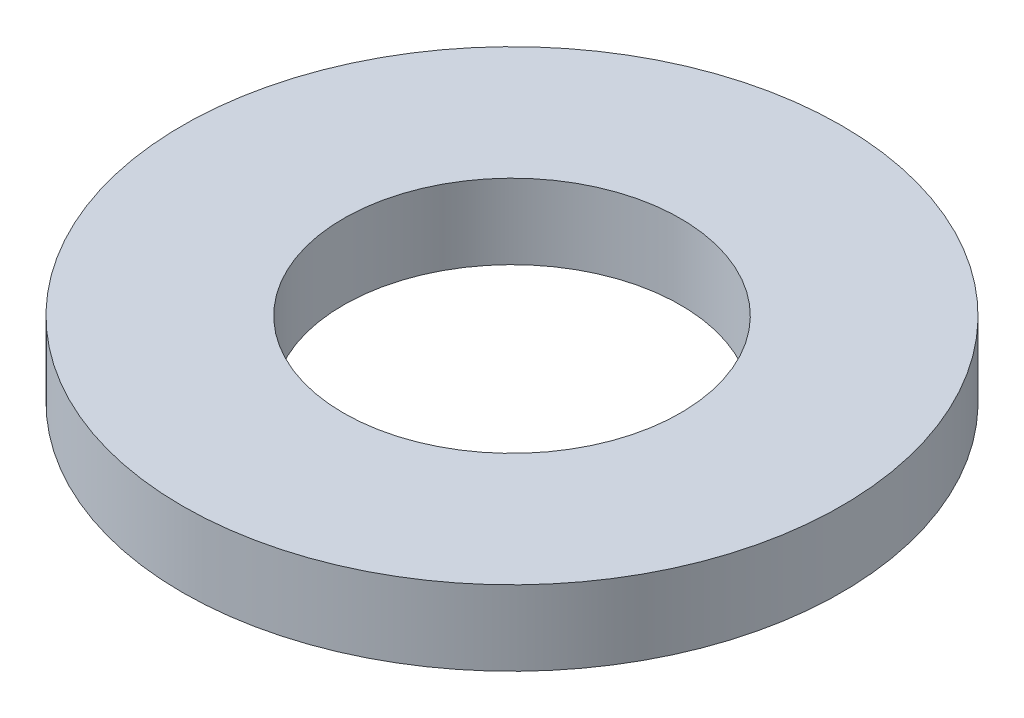
ISO-10303-21;
HEADER;
FILE_DESCRIPTION(('STEP AP214'),'2;1');
FILE_NAME('part.step','',(''),(''),'','','');
FILE_SCHEMA(('AUTOMOTIVE_DESIGN { 1 0 10303 214 1 1 1 1 }'));
ENDSEC;
DATA;
#1=APPLICATION_CONTEXT('core data for automotive mechanical design processes');
#2=APPLICATION_PROTOCOL_DEFINITION('international standard','automotive_design',2000,#1);
#3=PRODUCT_CONTEXT('',#1,'mechanical');
#4=PRODUCT('Part','Part','',(#3));
#5=PRODUCT_RELATED_PRODUCT_CATEGORY('part','',(#4));
#6=PRODUCT_DEFINITION_FORMATION('','',#4);
#7=PRODUCT_DEFINITION_CONTEXT('part definition',#1,'design');
#8=PRODUCT_DEFINITION('design','',#6,#7);
#9=PRODUCT_DEFINITION_SHAPE('','',#8);
#10=(LENGTH_UNIT() NAMED_UNIT(*) SI_UNIT(.MILLI.,.METRE.));
#11=(NAMED_UNIT(*) PLANE_ANGLE_UNIT() SI_UNIT($,.RADIAN.));
#12=(NAMED_UNIT(*) SI_UNIT($,.STERADIAN.) SOLID_ANGLE_UNIT());
#13=UNCERTAINTY_MEASURE_WITH_UNIT(LENGTH_MEASURE(1.E-05),#10,'distance_accuracy_value','');
#14=(GEOMETRIC_REPRESENTATION_CONTEXT(3) GLOBAL_UNCERTAINTY_ASSIGNED_CONTEXT((#13)) GLOBAL_UNIT_ASSIGNED_CONTEXT((#10,
#11,#12)) REPRESENTATION_CONTEXT('',''));
#15=CARTESIAN_POINT('',(0.,0.,0.));
#16=DIRECTION('',(0.,0.,1.));
#17=DIRECTION('',(1.,0.,0.));
#18=AXIS2_PLACEMENT_3D('',#15,#16,#17);
#19=CARTESIAN_POINT('',(0.,1.,0.));
#20=DIRECTION('',(0.,1.,0.));
#21=DIRECTION('',(0.,0.,1.));
#22=AXIS2_PLACEMENT_3D('',#19,#20,#21);
#23=PLANE('',#22);
#24=CARTESIAN_POINT('',(0.,1.,0.));
#25=DIRECTION('',(0.,1.,0.));
#26=DIRECTION('',(0.,0.,1.));
#27=AXIS2_PLACEMENT_3D('',#24,#25,#26);
#28=CIRCLE('',#27,4.4);
#29=CARTESIAN_POINT('',(0.,1.,4.4));
#30=VERTEX_POINT('',#29);
#31=EDGE_CURVE('E10',#30,#30,#28,.T.);
#32=ORIENTED_EDGE('',*,*,#31,.T.);
#33=EDGE_LOOP('',(#32));
#34=FACE_BOUND('',#33,.T.);
#35=CARTESIAN_POINT('',(0.,1.,0.));
#36=DIRECTION('',(0.,1.,0.));
#37=DIRECTION('',(0.,0.,1.));
#38=AXIS2_PLACEMENT_3D('',#35,#36,#37);
#39=CIRCLE('',#38,2.25);
#40=CARTESIAN_POINT('',(0.,1.,2.25));
#41=VERTEX_POINT('',#40);
#42=EDGE_CURVE('E50',#41,#41,#39,.T.);
#43=ORIENTED_EDGE('',*,*,#42,.F.);
#44=EDGE_LOOP('',(#43));
#45=FACE_BOUND('',#44,.T.);
#46=ADVANCED_FACE('F37',(#34,#45),#23,.T.);
#47=CARTESIAN_POINT('',(0.,0.,0.));
#48=DIRECTION('',(0.,1.,0.));
#49=DIRECTION('',(0.,0.,1.));
#50=AXIS2_PLACEMENT_3D('',#47,#48,#49);
#51=PLANE('',#50);
#52=CARTESIAN_POINT('',(0.,0.,0.));
#53=DIRECTION('',(0.,1.,0.));
#54=DIRECTION('',(0.,0.,1.));
#55=AXIS2_PLACEMENT_3D('',#52,#53,#54);
#56=CIRCLE('',#55,4.4);
#57=CARTESIAN_POINT('',(0.,0.,4.4));
#58=VERTEX_POINT('',#57);
#59=EDGE_CURVE('E41',#58,#58,#56,.T.);
#60=ORIENTED_EDGE('',*,*,#59,.F.);
#61=EDGE_LOOP('',(#60));
#62=FACE_BOUND('',#61,.T.);
#63=CARTESIAN_POINT('',(0.,0.,0.));
#64=DIRECTION('',(0.,1.,0.));
#65=DIRECTION('',(0.,0.,1.));
#66=AXIS2_PLACEMENT_3D('',#63,#64,#65);
#67=CIRCLE('',#66,2.25);
#68=CARTESIAN_POINT('',(0.,0.,2.25));
#69=VERTEX_POINT('',#68);
#70=EDGE_CURVE('E52',#69,#69,#67,.T.);
#71=ORIENTED_EDGE('',*,*,#70,.T.);
#72=EDGE_LOOP('',(#71));
#73=FACE_BOUND('',#72,.T.);
#74=ADVANCED_FACE('F64',(#62,#73),#51,.F.);
#75=CARTESIAN_POINT('',(0.,1.,0.));
#76=DIRECTION('',(0.,-1.,0.));
#77=DIRECTION('',(0.,0.,-1.));
#78=AXIS2_PLACEMENT_3D('',#75,#76,#77);
#79=CYLINDRICAL_SURFACE('',#78,4.4);
#80=ORIENTED_EDGE('',*,*,#31,.F.);
#81=EDGE_LOOP('',(#80));
#82=FACE_BOUND('',#81,.T.);
#83=ORIENTED_EDGE('',*,*,#59,.T.);
#84=EDGE_LOOP('',(#83));
#85=FACE_BOUND('',#84,.T.);
#86=ADVANCED_FACE('F39',(#82,#85),#79,.T.);
#87=CARTESIAN_POINT('',(0.,1.,0.));
#88=DIRECTION('',(0.,-1.,0.));
#89=DIRECTION('',(0.,0.,-1.));
#90=AXIS2_PLACEMENT_3D('',#87,#88,#89);
#91=CYLINDRICAL_SURFACE('',#90,2.25);
#92=ORIENTED_EDGE('',*,*,#42,.T.);
#93=EDGE_LOOP('',(#92));
#94=FACE_BOUND('',#93,.T.);
#95=ORIENTED_EDGE('',*,*,#70,.F.);
#96=EDGE_LOOP('',(#95));
#97=FACE_BOUND('',#96,.T.);
#98=ADVANCED_FACE('F60',(#94,#97),#91,.F.);
#99=CLOSED_SHELL('',(#46,#74,#86,#98));
#100=MANIFOLD_SOLID_BREP('B2',#99);
#101=ADVANCED_BREP_SHAPE_REPRESENTATION('',(#18,#100),#14);
#102=SHAPE_DEFINITION_REPRESENTATION(#9,#101);
ENDSEC;
END-ISO-10303-21;
